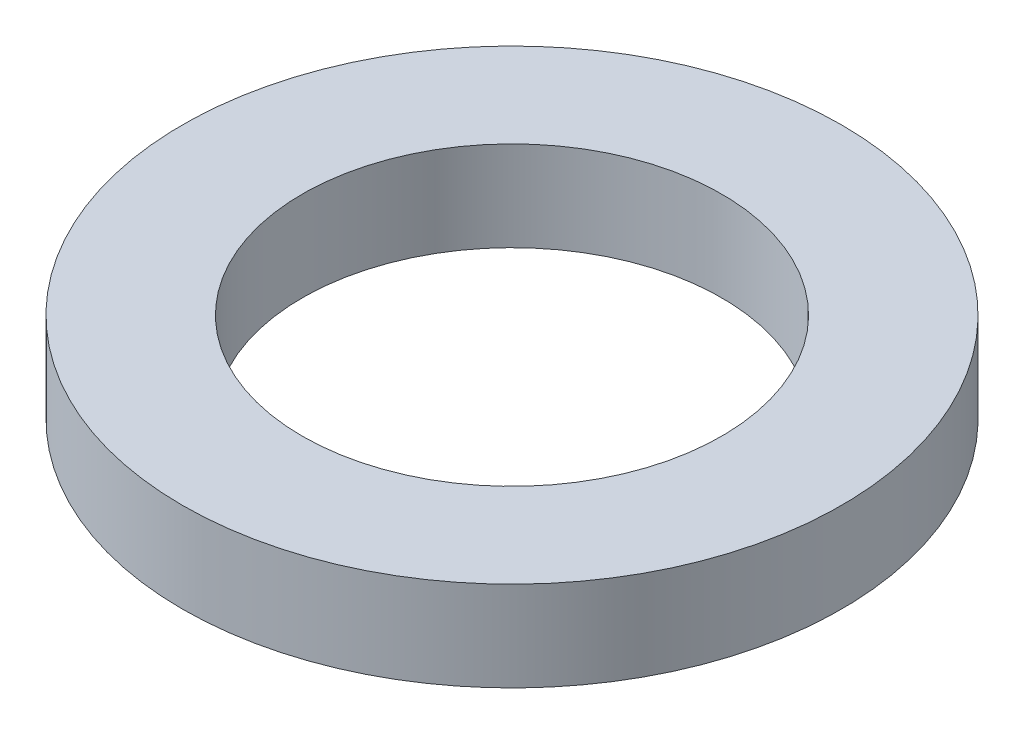
ISO-10303-21;
HEADER;
FILE_DESCRIPTION(('STEP AP214'),'2;1');
FILE_NAME('part.step','',(''),(''),'','','');
FILE_SCHEMA(('AUTOMOTIVE_DESIGN { 1 0 10303 214 1 1 1 1 }'));
ENDSEC;
DATA;
#1=APPLICATION_CONTEXT('core data for automotive mechanical design processes');
#2=APPLICATION_PROTOCOL_DEFINITION('international standard','automotive_design',2000,#1);
#3=PRODUCT_CONTEXT('',#1,'mechanical');
#4=PRODUCT('Part','Part','',(#3));
#5=PRODUCT_RELATED_PRODUCT_CATEGORY('part','',(#4));
#6=PRODUCT_DEFINITION_FORMATION('','',#4);
#7=PRODUCT_DEFINITION_CONTEXT('part definition',#1,'design');
#8=PRODUCT_DEFINITION('design','',#6,#7);
#9=PRODUCT_DEFINITION_SHAPE('','',#8);
#10=(LENGTH_UNIT() NAMED_UNIT(*) SI_UNIT(.MILLI.,.METRE.));
#11=(NAMED_UNIT(*) PLANE_ANGLE_UNIT() SI_UNIT($,.RADIAN.));
#12=(NAMED_UNIT(*) SI_UNIT($,.STERADIAN.) SOLID_ANGLE_UNIT());
#13=UNCERTAINTY_MEASURE_WITH_UNIT(LENGTH_MEASURE(1.E-05),#10,'distance_accuracy_value','');
#14=(GEOMETRIC_REPRESENTATION_CONTEXT(3) GLOBAL_UNCERTAINTY_ASSIGNED_CONTEXT((#13)) GLOBAL_UNIT_ASSIGNED_CONTEXT((#10,
#11,#12)) REPRESENTATION_CONTEXT('',''));
#15=CARTESIAN_POINT('',(0.,0.,0.));
#16=DIRECTION('',(0.,0.,1.));
#17=DIRECTION('',(1.,0.,0.));
#18=AXIS2_PLACEMENT_3D('',#15,#16,#17);
#19=CARTESIAN_POINT('',(0.,15.,0.));
#20=DIRECTION('',(0.,-1.,0.));
#21=DIRECTION('',(0.,0.,-1.));
#22=AXIS2_PLACEMENT_3D('',#19,#20,#21);
#23=CYLINDRICAL_SURFACE('',#22,55.);
#24=CARTESIAN_POINT('',(0.,15.,0.));
#25=DIRECTION('',(0.,1.,0.));
#26=DIRECTION('',(0.,0.,1.));
#27=AXIS2_PLACEMENT_3D('',#24,#25,#26);
#28=CIRCLE('',#27,55.);
#29=CARTESIAN_POINT('',(0.,15.,55.));
#30=VERTEX_POINT('',#29);
#31=EDGE_CURVE('E10',#30,#30,#28,.T.);
#32=ORIENTED_EDGE('',*,*,#31,.F.);
#33=EDGE_LOOP('',(#32));
#34=FACE_BOUND('',#33,.T.);
#35=CARTESIAN_POINT('',(0.,0.,0.));
#36=DIRECTION('',(0.,1.,0.));
#37=DIRECTION('',(0.,0.,1.));
#38=AXIS2_PLACEMENT_3D('',#35,#36,#37);
#39=CIRCLE('',#38,55.);
#40=CARTESIAN_POINT('',(0.,0.,55.));
#41=VERTEX_POINT('',#40);
#42=EDGE_CURVE('E37',#41,#41,#39,.T.);
#43=ORIENTED_EDGE('',*,*,#42,.T.);
#44=EDGE_LOOP('',(#43));
#45=FACE_BOUND('',#44,.T.);
#46=ADVANCED_FACE('F40',(#34,#45),#23,.T.);
#47=CARTESIAN_POINT('',(0.,15.,0.));
#48=DIRECTION('',(0.,1.,0.));
#49=DIRECTION('',(0.,0.,1.));
#50=AXIS2_PLACEMENT_3D('',#47,#48,#49);
#51=PLANE('',#50);
#52=CARTESIAN_POINT('',(0.,15.,0.));
#53=DIRECTION('',(0.,1.,0.));
#54=DIRECTION('',(0.,0.,1.));
#55=AXIS2_PLACEMENT_3D('',#52,#53,#54);
#56=CIRCLE('',#55,35.);
#57=CARTESIAN_POINT('',(0.,15.,35.));
#58=VERTEX_POINT('',#57);
#59=EDGE_CURVE('E50',#58,#58,#56,.T.);
#60=ORIENTED_EDGE('',*,*,#59,.F.);
#61=EDGE_LOOP('',(#60));
#62=FACE_BOUND('',#61,.T.);
#63=ORIENTED_EDGE('',*,*,#31,.T.);
#64=EDGE_LOOP('',(#63));
#65=FACE_BOUND('',#64,.T.);
#66=ADVANCED_FACE('F59',(#62,#65),#51,.T.);
#67=CARTESIAN_POINT('',(0.,0.,0.));
#68=DIRECTION('',(0.,1.,0.));
#69=DIRECTION('',(0.,0.,1.));
#70=AXIS2_PLACEMENT_3D('',#67,#68,#69);
#71=PLANE('',#70);
#72=CARTESIAN_POINT('',(0.,0.,0.));
#73=DIRECTION('',(0.,1.,0.));
#74=DIRECTION('',(0.,0.,1.));
#75=AXIS2_PLACEMENT_3D('',#72,#73,#74);
#76=CIRCLE('',#75,35.);
#77=CARTESIAN_POINT('',(0.,0.,35.));
#78=VERTEX_POINT('',#77);
#79=EDGE_CURVE('E47',#78,#78,#76,.T.);
#80=ORIENTED_EDGE('',*,*,#79,.T.);
#81=EDGE_LOOP('',(#80));
#82=FACE_BOUND('',#81,.T.);
#83=ORIENTED_EDGE('',*,*,#42,.F.);
#84=EDGE_LOOP('',(#83));
#85=FACE_BOUND('',#84,.T.);
#86=ADVANCED_FACE('F58',(#82,#85),#71,.F.);
#87=CARTESIAN_POINT('',(0.,15.,0.));
#88=DIRECTION('',(0.,-1.,0.));
#89=DIRECTION('',(0.,0.,-1.));
#90=AXIS2_PLACEMENT_3D('',#87,#88,#89);
#91=CYLINDRICAL_SURFACE('',#90,35.);
#92=ORIENTED_EDGE('',*,*,#59,.T.);
#93=EDGE_LOOP('',(#92));
#94=FACE_BOUND('',#93,.T.);
#95=ORIENTED_EDGE('',*,*,#79,.F.);
#96=EDGE_LOOP('',(#95));
#97=FACE_BOUND('',#96,.T.);
#98=ADVANCED_FACE('F54',(#94,#97),#91,.F.);
#99=CLOSED_SHELL('',(#46,#66,#86,#98));
#100=MANIFOLD_SOLID_BREP('B2',#99);
#101=ADVANCED_BREP_SHAPE_REPRESENTATION('',(#18,#100),#14);
#102=SHAPE_DEFINITION_REPRESENTATION(#9,#101);
ENDSEC;
END-ISO-10303-21;
